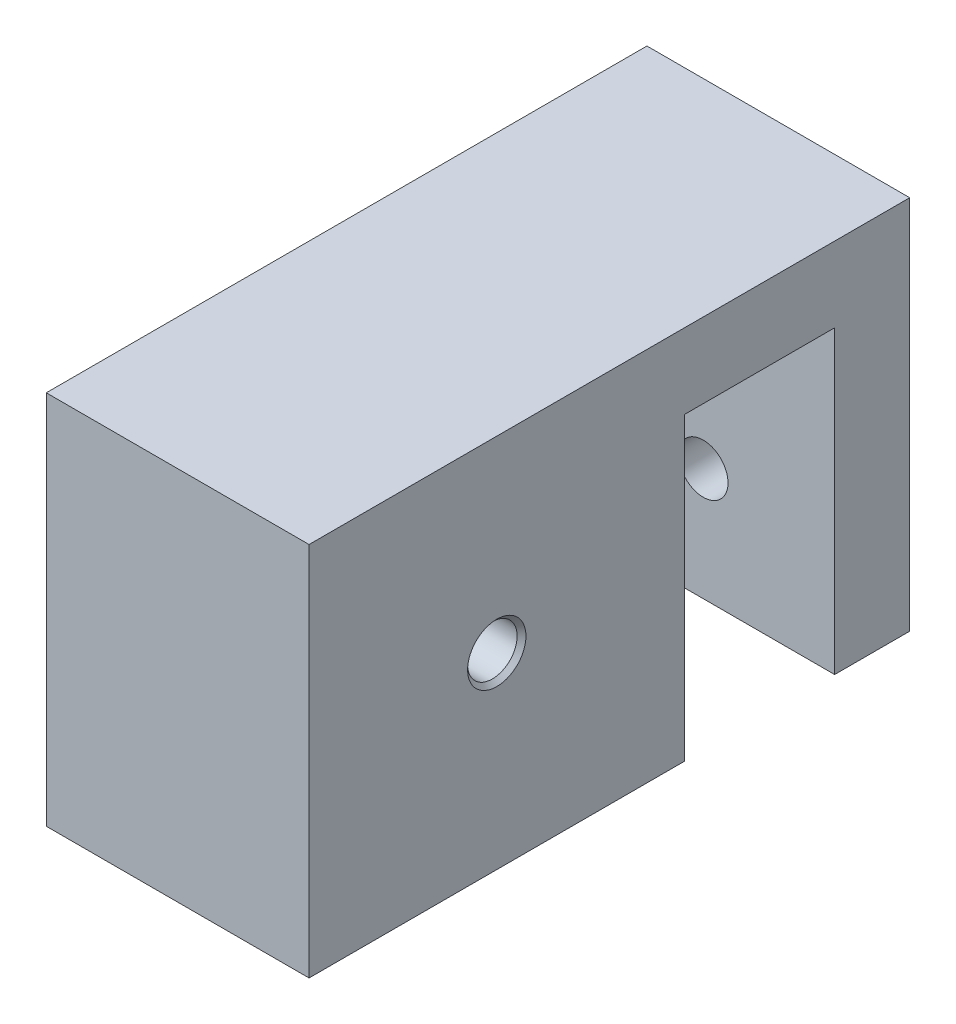
ISO-10303-21;
HEADER;
FILE_DESCRIPTION(('STEP AP214'),'2;1');
FILE_NAME('part.step','',(''),(''),'','','');
FILE_SCHEMA(('AUTOMOTIVE_DESIGN { 1 0 10303 214 1 1 1 1 }'));
ENDSEC;
DATA;
#1=APPLICATION_CONTEXT('core data for automotive mechanical design processes');
#2=APPLICATION_PROTOCOL_DEFINITION('international standard','automotive_design',2000,#1);
#3=PRODUCT_CONTEXT('',#1,'mechanical');
#4=PRODUCT('Part','Part','',(#3));
#5=PRODUCT_RELATED_PRODUCT_CATEGORY('part','',(#4));
#6=PRODUCT_DEFINITION_FORMATION('','',#4);
#7=PRODUCT_DEFINITION_CONTEXT('part definition',#1,'design');
#8=PRODUCT_DEFINITION('design','',#6,#7);
#9=PRODUCT_DEFINITION_SHAPE('','',#8);
#10=(LENGTH_UNIT() NAMED_UNIT(*) SI_UNIT(.MILLI.,.METRE.));
#11=(NAMED_UNIT(*) PLANE_ANGLE_UNIT() SI_UNIT($,.RADIAN.));
#12=(NAMED_UNIT(*) SI_UNIT($,.STERADIAN.) SOLID_ANGLE_UNIT());
#13=UNCERTAINTY_MEASURE_WITH_UNIT(LENGTH_MEASURE(1.E-05),#10,'distance_accuracy_value','');
#14=(GEOMETRIC_REPRESENTATION_CONTEXT(3) GLOBAL_UNCERTAINTY_ASSIGNED_CONTEXT((#13)) GLOBAL_UNIT_ASSIGNED_CONTEXT((#10,
#11,#12)) REPRESENTATION_CONTEXT('',''));
#15=CARTESIAN_POINT('',(0.,0.,0.));
#16=DIRECTION('',(0.,0.,1.));
#17=DIRECTION('',(1.,0.,0.));
#18=AXIS2_PLACEMENT_3D('',#15,#16,#17);
#19=CARTESIAN_POINT('',(35.,-9.99999999999999,-80.));
#20=DIRECTION('',(0.,1.,0.));
#21=DIRECTION('',(0.,0.,1.));
#22=AXIS2_PLACEMENT_3D('',#19,#20,#21);
#23=PLANE('',#22);
#24=DIRECTION('',(-1.,0.,0.));
#25=VECTOR('',#24,1.);
#26=CARTESIAN_POINT('',(0.,-10.,-70.));
#27=LINE('',#26,#25);
#28=CARTESIAN_POINT('',(35.,-9.99999999999999,-70.));
#29=VERTEX_POINT('',#28);
#30=CARTESIAN_POINT('',(0.,-10.,-70.));
#31=VERTEX_POINT('',#30);
#32=EDGE_CURVE('E145',#29,#31,#27,.T.);
#33=ORIENTED_EDGE('',*,*,#32,.F.);
#34=DIRECTION('',(0.,0.,1.));
#35=VECTOR('',#34,1.);
#36=CARTESIAN_POINT('',(35.,-9.99999999999999,-80.));
#37=LINE('',#36,#35);
#38=CARTESIAN_POINT('',(35.,-10.,-50.));
#39=VERTEX_POINT('',#38);
#40=EDGE_CURVE('E59',#29,#39,#37,.T.);
#41=ORIENTED_EDGE('',*,*,#40,.T.);
#42=DIRECTION('',(-1.,0.,0.));
#43=VECTOR('',#42,1.);
#44=CARTESIAN_POINT('',(35.,-10.,-50.));
#45=LINE('',#44,#43);
#46=CARTESIAN_POINT('',(0.,-10.,-50.));
#47=VERTEX_POINT('',#46);
#48=EDGE_CURVE('E163',#39,#47,#45,.T.);
#49=ORIENTED_EDGE('',*,*,#48,.T.);
#50=DIRECTION('',(0.,0.,1.));
#51=VECTOR('',#50,1.);
#52=CARTESIAN_POINT('',(0.,-9.99999999999999,-80.));
#53=LINE('',#52,#51);
#54=EDGE_CURVE('E168',#31,#47,#53,.T.);
#55=ORIENTED_EDGE('',*,*,#54,.F.);
#56=EDGE_LOOP('',(#33,#41,#49,#55));
#57=FACE_BOUND('',#56,.T.);
#58=ADVANCED_FACE('F41',(#57),#23,.F.);
#59=CARTESIAN_POINT('',(35.,0.,-50.));
#60=DIRECTION('',(0.,0.,1.));
#61=DIRECTION('',(0.,-1.,0.));
#62=AXIS2_PLACEMENT_3D('',#59,#60,#61);
#63=PLANE('',#62);
#64=ORIENTED_EDGE('',*,*,#48,.F.);
#65=DIRECTION('',(0.,1.,0.));
#66=VECTOR('',#65,1.);
#67=CARTESIAN_POINT('',(35.,0.,-50.));
#68=LINE('',#67,#66);
#69=CARTESIAN_POINT('',(35.,-50.,-50.));
#70=VERTEX_POINT('',#69);
#71=EDGE_CURVE('E198',#70,#39,#68,.T.);
#72=ORIENTED_EDGE('',*,*,#71,.F.);
#73=DIRECTION('',(-1.,0.,0.));
#74=VECTOR('',#73,1.);
#75=CARTESIAN_POINT('',(35.,-50.,-50.));
#76=LINE('',#75,#74);
#77=CARTESIAN_POINT('',(0.,-50.,-50.));
#78=VERTEX_POINT('',#77);
#79=EDGE_CURVE('E51',#70,#78,#76,.T.);
#80=ORIENTED_EDGE('',*,*,#79,.T.);
#81=DIRECTION('',(0.,1.,0.));
#82=VECTOR('',#81,1.);
#83=CARTESIAN_POINT('',(0.,0.,-50.));
#84=LINE('',#83,#82);
#85=EDGE_CURVE('E211',#78,#47,#84,.T.);
#86=ORIENTED_EDGE('',*,*,#85,.T.);
#87=EDGE_LOOP('',(#64,#72,#80,#86));
#88=FACE_BOUND('',#87,.T.);
#89=ADVANCED_FACE('F251',(#88),#63,.F.);
#90=CARTESIAN_POINT('',(35.,0.,0.));
#91=DIRECTION('',(0.,0.,-1.));
#92=DIRECTION('',(0.,1.,0.));
#93=AXIS2_PLACEMENT_3D('',#90,#91,#92);
#94=PLANE('',#93);
#95=DIRECTION('',(0.,-1.,0.));
#96=VECTOR('',#95,1.);
#97=CARTESIAN_POINT('',(0.,0.,0.));
#98=LINE('',#97,#96);
#99=CARTESIAN_POINT('',(0.,0.,0.));
#100=VERTEX_POINT('',#99);
#101=CARTESIAN_POINT('',(0.,-50.,0.));
#102=VERTEX_POINT('',#101);
#103=EDGE_CURVE('E188',#100,#102,#98,.T.);
#104=ORIENTED_EDGE('',*,*,#103,.T.);
#105=DIRECTION('',(-1.,0.,0.));
#106=VECTOR('',#105,1.);
#107=CARTESIAN_POINT('',(35.,-50.,0.));
#108=LINE('',#107,#106);
#109=CARTESIAN_POINT('',(35.,-50.,0.));
#110=VERTEX_POINT('',#109);
#111=EDGE_CURVE('E11',#110,#102,#108,.T.);
#112=ORIENTED_EDGE('',*,*,#111,.F.);
#113=DIRECTION('',(0.,-1.,0.));
#114=VECTOR('',#113,1.);
#115=CARTESIAN_POINT('',(35.,0.,0.));
#116=LINE('',#115,#114);
#117=CARTESIAN_POINT('',(35.,0.,0.));
#118=VERTEX_POINT('',#117);
#119=EDGE_CURVE('E193',#118,#110,#116,.T.);
#120=ORIENTED_EDGE('',*,*,#119,.F.);
#121=DIRECTION('',(-1.,0.,0.));
#122=VECTOR('',#121,1.);
#123=CARTESIAN_POINT('',(35.,0.,0.));
#124=LINE('',#123,#122);
#125=EDGE_CURVE('E204',#118,#100,#124,.T.);
#126=ORIENTED_EDGE('',*,*,#125,.T.);
#127=EDGE_LOOP('',(#104,#112,#120,#126));
#128=FACE_BOUND('',#127,.T.);
#129=ADVANCED_FACE('F43',(#128),#94,.F.);
#130=CARTESIAN_POINT('',(35.,-50.,0.));
#131=DIRECTION('',(0.,1.,0.));
#132=DIRECTION('',(0.,0.,1.));
#133=AXIS2_PLACEMENT_3D('',#130,#131,#132);
#134=PLANE('',#133);
#135=DIRECTION('',(0.,0.,-1.));
#136=VECTOR('',#135,1.);
#137=CARTESIAN_POINT('',(0.,-50.,0.));
#138=LINE('',#137,#136);
#139=EDGE_CURVE('E208',#102,#78,#138,.T.);
#140=ORIENTED_EDGE('',*,*,#139,.T.);
#141=ORIENTED_EDGE('',*,*,#79,.F.);
#142=DIRECTION('',(0.,0.,-1.));
#143=VECTOR('',#142,1.);
#144=CARTESIAN_POINT('',(35.,-50.,0.));
#145=LINE('',#144,#143);
#146=EDGE_CURVE('E91',#110,#70,#145,.T.);
#147=ORIENTED_EDGE('',*,*,#146,.F.);
#148=ORIENTED_EDGE('',*,*,#111,.T.);
#149=EDGE_LOOP('',(#140,#141,#147,#148));
#150=FACE_BOUND('',#149,.T.);
#151=ADVANCED_FACE('F352',(#150),#134,.F.);
#152=CARTESIAN_POINT('',(35.,0.,0.));
#153=DIRECTION('',(0.,-1.,0.));
#154=DIRECTION('',(0.,0.,-1.));
#155=AXIS2_PLACEMENT_3D('',#152,#153,#154);
#156=PLANE('',#155);
#157=DIRECTION('',(0.,0.,1.));
#158=VECTOR('',#157,1.);
#159=CARTESIAN_POINT('',(0.,0.,0.));
#160=LINE('',#159,#158);
#161=CARTESIAN_POINT('',(0.,0.,-80.));
#162=VERTEX_POINT('',#161);
#163=EDGE_CURVE('E86',#162,#100,#160,.T.);
#164=ORIENTED_EDGE('',*,*,#163,.T.);
#165=ORIENTED_EDGE('',*,*,#125,.F.);
#166=DIRECTION('',(0.,0.,1.));
#167=VECTOR('',#166,1.);
#168=CARTESIAN_POINT('',(35.,0.,0.));
#169=LINE('',#168,#167);
#170=CARTESIAN_POINT('',(35.,0.,-80.));
#171=VERTEX_POINT('',#170);
#172=EDGE_CURVE('E68',#171,#118,#169,.T.);
#173=ORIENTED_EDGE('',*,*,#172,.F.);
#174=DIRECTION('',(1.,0.,0.));
#175=VECTOR('',#174,1.);
#176=CARTESIAN_POINT('',(35.,0.,-80.));
#177=LINE('',#176,#175);
#178=EDGE_CURVE('E129',#162,#171,#177,.T.);
#179=ORIENTED_EDGE('',*,*,#178,.F.);
#180=EDGE_LOOP('',(#164,#165,#173,#179));
#181=FACE_BOUND('',#180,.T.);
#182=ADVANCED_FACE('F246',(#181),#156,.F.);
#183=CARTESIAN_POINT('',(35.,0.,0.));
#184=DIRECTION('',(1.,0.,0.));
#185=DIRECTION('',(0.,0.,-1.));
#186=AXIS2_PLACEMENT_3D('',#183,#184,#185);
#187=PLANE('',#186);
#188=CARTESIAN_POINT('',(35.,-25.,-25.));
#189=DIRECTION('',(1.,0.,0.));
#190=DIRECTION('',(0.,0.,-1.));
#191=AXIS2_PLACEMENT_3D('',#188,#189,#190);
#192=CIRCLE('',#191,3.8865);
#193=CARTESIAN_POINT('',(35.,-25.,-28.8865));
#194=VERTEX_POINT('',#193);
#195=EDGE_CURVE('E175',#194,#194,#192,.T.);
#196=ORIENTED_EDGE('',*,*,#195,.F.);
#197=EDGE_LOOP('',(#196));
#198=FACE_BOUND('',#197,.T.);
#199=ORIENTED_EDGE('',*,*,#119,.T.);
#200=ORIENTED_EDGE('',*,*,#146,.T.);
#201=ORIENTED_EDGE('',*,*,#71,.T.);
#202=ORIENTED_EDGE('',*,*,#40,.F.);
#203=DIRECTION('',(0.,1.,0.));
#204=VECTOR('',#203,1.);
#205=CARTESIAN_POINT('',(35.,-50.,-70.));
#206=LINE('',#205,#204);
#207=CARTESIAN_POINT('',(35.,-50.,-70.));
#208=VERTEX_POINT('',#207);
#209=EDGE_CURVE('E160',#208,#29,#206,.T.);
#210=ORIENTED_EDGE('',*,*,#209,.F.);
#211=DIRECTION('',(0.,0.,1.));
#212=VECTOR('',#211,1.);
#213=CARTESIAN_POINT('',(35.,-50.,-80.));
#214=LINE('',#213,#212);
#215=CARTESIAN_POINT('',(35.,-50.,-80.));
#216=VERTEX_POINT('',#215);
#217=EDGE_CURVE('E138',#216,#208,#214,.T.);
#218=ORIENTED_EDGE('',*,*,#217,.F.);
#219=DIRECTION('',(0.,-1.,0.));
#220=VECTOR('',#219,1.);
#221=CARTESIAN_POINT('',(35.,0.,-80.));
#222=LINE('',#221,#220);
#223=EDGE_CURVE('E130',#171,#216,#222,.T.);
#224=ORIENTED_EDGE('',*,*,#223,.F.);
#225=ORIENTED_EDGE('',*,*,#172,.T.);
#226=EDGE_LOOP('',(#199,#200,#201,#202,#210,#218,#224,#225));
#227=FACE_BOUND('',#226,.T.);
#228=ADVANCED_FACE('F241',(#198,#227),#187,.T.);
#229=CARTESIAN_POINT('',(0.,0.,0.));
#230=DIRECTION('',(1.,0.,0.));
#231=DIRECTION('',(0.,0.,-1.));
#232=AXIS2_PLACEMENT_3D('',#229,#230,#231);
#233=PLANE('',#232);
#234=CARTESIAN_POINT('',(0.,-25.,-25.));
#235=DIRECTION('',(-1.,0.,0.));
#236=DIRECTION('',(0.,0.,1.));
#237=AXIS2_PLACEMENT_3D('',#234,#235,#236);
#238=CIRCLE('',#237,20.);
#239=CARTESIAN_POINT('',(0.,-25.,-5.));
#240=VERTEX_POINT('',#239);
#241=EDGE_CURVE('E189',#240,#240,#238,.T.);
#242=ORIENTED_EDGE('',*,*,#241,.F.);
#243=EDGE_LOOP('',(#242));
#244=FACE_BOUND('',#243,.T.);
#245=ORIENTED_EDGE('',*,*,#103,.F.);
#246=ORIENTED_EDGE('',*,*,#163,.F.);
#247=DIRECTION('',(0.,1.,0.));
#248=VECTOR('',#247,1.);
#249=CARTESIAN_POINT('',(0.,0.,-80.));
#250=LINE('',#249,#248);
#251=CARTESIAN_POINT('',(0.,-50.,-80.));
#252=VERTEX_POINT('',#251);
#253=EDGE_CURVE('E119',#252,#162,#250,.T.);
#254=ORIENTED_EDGE('',*,*,#253,.F.);
#255=DIRECTION('',(0.,0.,-1.));
#256=VECTOR('',#255,1.);
#257=CARTESIAN_POINT('',(0.,-50.,-80.));
#258=LINE('',#257,#256);
#259=CARTESIAN_POINT('',(0.,-50.,-70.));
#260=VERTEX_POINT('',#259);
#261=EDGE_CURVE('E125',#260,#252,#258,.T.);
#262=ORIENTED_EDGE('',*,*,#261,.F.);
#263=DIRECTION('',(0.,1.,0.));
#264=VECTOR('',#263,1.);
#265=CARTESIAN_POINT('',(0.,-50.,-70.));
#266=LINE('',#265,#264);
#267=EDGE_CURVE('E156',#260,#31,#266,.T.);
#268=ORIENTED_EDGE('',*,*,#267,.T.);
#269=ORIENTED_EDGE('',*,*,#54,.T.);
#270=ORIENTED_EDGE('',*,*,#85,.F.);
#271=ORIENTED_EDGE('',*,*,#139,.F.);
#272=EDGE_LOOP('',(#245,#246,#254,#262,#268,#269,#270,#271));
#273=FACE_BOUND('',#272,.T.);
#274=ADVANCED_FACE('F122',(#244,#273),#233,.F.);
#275=CARTESIAN_POINT('',(20.,-25.,-25.));
#276=DIRECTION('',(-1.,0.,0.));
#277=DIRECTION('',(0.,0.,1.));
#278=AXIS2_PLACEMENT_3D('',#275,#276,#277);
#279=CYLINDRICAL_SURFACE('',#278,20.);
#280=CARTESIAN_POINT('',(20.,-25.,-25.));
#281=DIRECTION('',(-1.,0.,0.));
#282=DIRECTION('',(0.,0.,1.));
#283=AXIS2_PLACEMENT_3D('',#280,#281,#282);
#284=CIRCLE('',#283,20.);
#285=CARTESIAN_POINT('',(20.,-25.,-5.));
#286=VERTEX_POINT('',#285);
#287=EDGE_CURVE('E184',#286,#286,#284,.T.);
#288=ORIENTED_EDGE('',*,*,#287,.F.);
#289=EDGE_LOOP('',(#288));
#290=FACE_BOUND('',#289,.T.);
#291=ORIENTED_EDGE('',*,*,#241,.T.);
#292=EDGE_LOOP('',(#291));
#293=FACE_BOUND('',#292,.T.);
#294=ADVANCED_FACE('F231',(#290,#293),#279,.F.);
#295=CARTESIAN_POINT('',(20.,-25.,-25.));
#296=DIRECTION('',(-1.,0.,0.));
#297=DIRECTION('',(0.,0.,1.));
#298=AXIS2_PLACEMENT_3D('',#295,#296,#297);
#299=PLANE('',#298);
#300=CARTESIAN_POINT('',(20.,-25.,-25.));
#301=DIRECTION('',(-1.,0.,0.));
#302=DIRECTION('',(0.,0.,1.));
#303=AXIS2_PLACEMENT_3D('',#300,#301,#302);
#304=CIRCLE('',#303,3.29999999999999);
#305=CARTESIAN_POINT('',(20.,-25.,-21.7));
#306=VERTEX_POINT('',#305);
#307=EDGE_CURVE('E183',#306,#306,#304,.T.);
#308=ORIENTED_EDGE('',*,*,#307,.F.);
#309=EDGE_LOOP('',(#308));
#310=FACE_BOUND('',#309,.T.);
#311=ORIENTED_EDGE('',*,*,#287,.T.);
#312=EDGE_LOOP('',(#311));
#313=FACE_BOUND('',#312,.T.);
#314=ADVANCED_FACE('F228',(#310,#313),#299,.T.);
#315=CARTESIAN_POINT('',(35.,-25.,-25.));
#316=DIRECTION('',(1.,0.,0.));
#317=DIRECTION('',(0.,0.,-1.));
#318=AXIS2_PLACEMENT_3D('',#315,#316,#317);
#319=CYLINDRICAL_SURFACE('',#318,3.29999999999999);
#320=ORIENTED_EDGE('',*,*,#307,.T.);
#321=EDGE_LOOP('',(#320));
#322=FACE_BOUND('',#321,.T.);
#323=CARTESIAN_POINT('',(34.4135,-25.,-25.));
#324=DIRECTION('',(1.,0.,0.));
#325=DIRECTION('',(0.,0.,-1.));
#326=AXIS2_PLACEMENT_3D('',#323,#324,#325);
#327=CIRCLE('',#326,3.3);
#328=CARTESIAN_POINT('',(34.4135,-25.,-28.3));
#329=VERTEX_POINT('',#328);
#330=EDGE_CURVE('E179',#329,#329,#327,.T.);
#331=ORIENTED_EDGE('',*,*,#330,.T.);
#332=EDGE_LOOP('',(#331));
#333=FACE_BOUND('',#332,.T.);
#334=ADVANCED_FACE('F225',(#322,#333),#319,.F.);
#335=CARTESIAN_POINT('',(35.,-25.,-25.));
#336=DIRECTION('',(1.,0.,0.));
#337=DIRECTION('',(0.,0.,-1.));
#338=AXIS2_PLACEMENT_3D('',#335,#336,#337);
#339=CONICAL_SURFACE('',#338,3.8865,0.785398163397448);
#340=ORIENTED_EDGE('',*,*,#330,.F.);
#341=EDGE_LOOP('',(#340));
#342=FACE_BOUND('',#341,.T.);
#343=ORIENTED_EDGE('',*,*,#195,.T.);
#344=EDGE_LOOP('',(#343));
#345=FACE_BOUND('',#344,.T.);
#346=ADVANCED_FACE('F261',(#342,#345),#339,.F.);
#347=CARTESIAN_POINT('',(0.,0.,-80.));
#348=DIRECTION('',(0.,0.,-1.));
#349=DIRECTION('',(-1.,0.,0.));
#350=AXIS2_PLACEMENT_3D('',#347,#348,#349);
#351=PLANE('',#350);
#352=CARTESIAN_POINT('',(17.5,-35.,-80.));
#353=DIRECTION('',(0.,0.,-1.));
#354=DIRECTION('',(-1.,0.,0.));
#355=AXIS2_PLACEMENT_3D('',#352,#353,#354);
#356=CIRCLE('',#355,3.8865);
#357=CARTESIAN_POINT('',(13.6135,-35.,-80.));
#358=VERTEX_POINT('',#357);
#359=EDGE_CURVE('E412',#358,#358,#356,.T.);
#360=ORIENTED_EDGE('',*,*,#359,.F.);
#361=EDGE_LOOP('',(#360));
#362=FACE_BOUND('',#361,.T.);
#363=ORIENTED_EDGE('',*,*,#223,.T.);
#364=DIRECTION('',(1.,0.,0.));
#365=VECTOR('',#364,1.);
#366=CARTESIAN_POINT('',(0.,-50.,-80.));
#367=LINE('',#366,#365);
#368=EDGE_CURVE('E133',#252,#216,#367,.T.);
#369=ORIENTED_EDGE('',*,*,#368,.F.);
#370=ORIENTED_EDGE('',*,*,#253,.T.);
#371=ORIENTED_EDGE('',*,*,#178,.T.);
#372=EDGE_LOOP('',(#363,#369,#370,#371));
#373=FACE_BOUND('',#372,.T.);
#374=ADVANCED_FACE('F134',(#362,#373),#351,.T.);
#375=CARTESIAN_POINT('',(0.,-50.,-70.));
#376=DIRECTION('',(0.,0.,-1.));
#377=DIRECTION('',(0.,1.,0.));
#378=AXIS2_PLACEMENT_3D('',#375,#376,#377);
#379=PLANE('',#378);
#380=CARTESIAN_POINT('',(17.5,-35.,-70.));
#381=DIRECTION('',(0.,0.,-1.));
#382=DIRECTION('',(0.,1.,0.));
#383=AXIS2_PLACEMENT_3D('',#380,#381,#382);
#384=CIRCLE('',#383,3.29999999999999);
#385=CARTESIAN_POINT('',(17.5,-31.7,-70.));
#386=VERTEX_POINT('',#385);
#387=EDGE_CURVE('E45',#386,#386,#384,.T.);
#388=ORIENTED_EDGE('',*,*,#387,.T.);
#389=EDGE_LOOP('',(#388));
#390=FACE_BOUND('',#389,.T.);
#391=ORIENTED_EDGE('',*,*,#32,.T.);
#392=ORIENTED_EDGE('',*,*,#267,.F.);
#393=DIRECTION('',(-1.,0.,0.));
#394=VECTOR('',#393,1.);
#395=CARTESIAN_POINT('',(0.,-50.,-70.));
#396=LINE('',#395,#394);
#397=EDGE_CURVE('E142',#208,#260,#396,.T.);
#398=ORIENTED_EDGE('',*,*,#397,.F.);
#399=ORIENTED_EDGE('',*,*,#209,.T.);
#400=EDGE_LOOP('',(#391,#392,#398,#399));
#401=FACE_BOUND('',#400,.T.);
#402=ADVANCED_FACE('F282',(#390,#401),#379,.F.);
#403=CARTESIAN_POINT('',(0.,-50.,0.));
#404=DIRECTION('',(0.,1.,0.));
#405=DIRECTION('',(0.,0.,1.));
#406=AXIS2_PLACEMENT_3D('',#403,#404,#405);
#407=PLANE('',#406);
#408=ORIENTED_EDGE('',*,*,#261,.T.);
#409=ORIENTED_EDGE('',*,*,#368,.T.);
#410=ORIENTED_EDGE('',*,*,#217,.T.);
#411=ORIENTED_EDGE('',*,*,#397,.T.);
#412=EDGE_LOOP('',(#408,#409,#410,#411));
#413=FACE_BOUND('',#412,.T.);
#414=ADVANCED_FACE('F140',(#413),#407,.F.);
#415=CARTESIAN_POINT('',(17.5,-35.,-80.));
#416=DIRECTION('',(0.,0.,-1.));
#417=DIRECTION('',(-1.,0.,0.));
#418=AXIS2_PLACEMENT_3D('',#415,#416,#417);
#419=CYLINDRICAL_SURFACE('',#418,3.29999999999999);
#420=CARTESIAN_POINT('',(17.5,-35.,-79.4135));
#421=DIRECTION('',(0.,0.,-1.));
#422=DIRECTION('',(-1.,0.,0.));
#423=AXIS2_PLACEMENT_3D('',#420,#421,#422);
#424=CIRCLE('',#423,3.29999999999999);
#425=CARTESIAN_POINT('',(14.2,-35.,-79.4135));
#426=VERTEX_POINT('',#425);
#427=EDGE_CURVE('E150',#426,#426,#424,.T.);
#428=ORIENTED_EDGE('',*,*,#427,.T.);
#429=EDGE_LOOP('',(#428));
#430=FACE_BOUND('',#429,.T.);
#431=ORIENTED_EDGE('',*,*,#387,.F.);
#432=EDGE_LOOP('',(#431));
#433=FACE_BOUND('',#432,.T.);
#434=ADVANCED_FACE('F296',(#430,#433),#419,.F.);
#435=CARTESIAN_POINT('',(17.5,-35.,-80.));
#436=DIRECTION('',(0.,0.,-1.));
#437=DIRECTION('',(-1.,0.,0.));
#438=AXIS2_PLACEMENT_3D('',#435,#436,#437);
#439=CONICAL_SURFACE('',#438,3.8865,0.785398163397442);
#440=ORIENTED_EDGE('',*,*,#427,.F.);
#441=EDGE_LOOP('',(#440));
#442=FACE_BOUND('',#441,.T.);
#443=ORIENTED_EDGE('',*,*,#359,.T.);
#444=EDGE_LOOP('',(#443));
#445=FACE_BOUND('',#444,.T.);
#446=ADVANCED_FACE('F302',(#442,#445),#439,.F.);
#447=CLOSED_SHELL('',(#58,#89,#129,#151,#182,#228,#274,#294,#314,#334,#346,#374,#402,#414,#434,#446));
#448=MANIFOLD_SOLID_BREP('B2',#447);
#449=ADVANCED_BREP_SHAPE_REPRESENTATION('',(#18,#448),#14);
#450=SHAPE_DEFINITION_REPRESENTATION(#9,#449);
ENDSEC;
END-ISO-10303-21;
